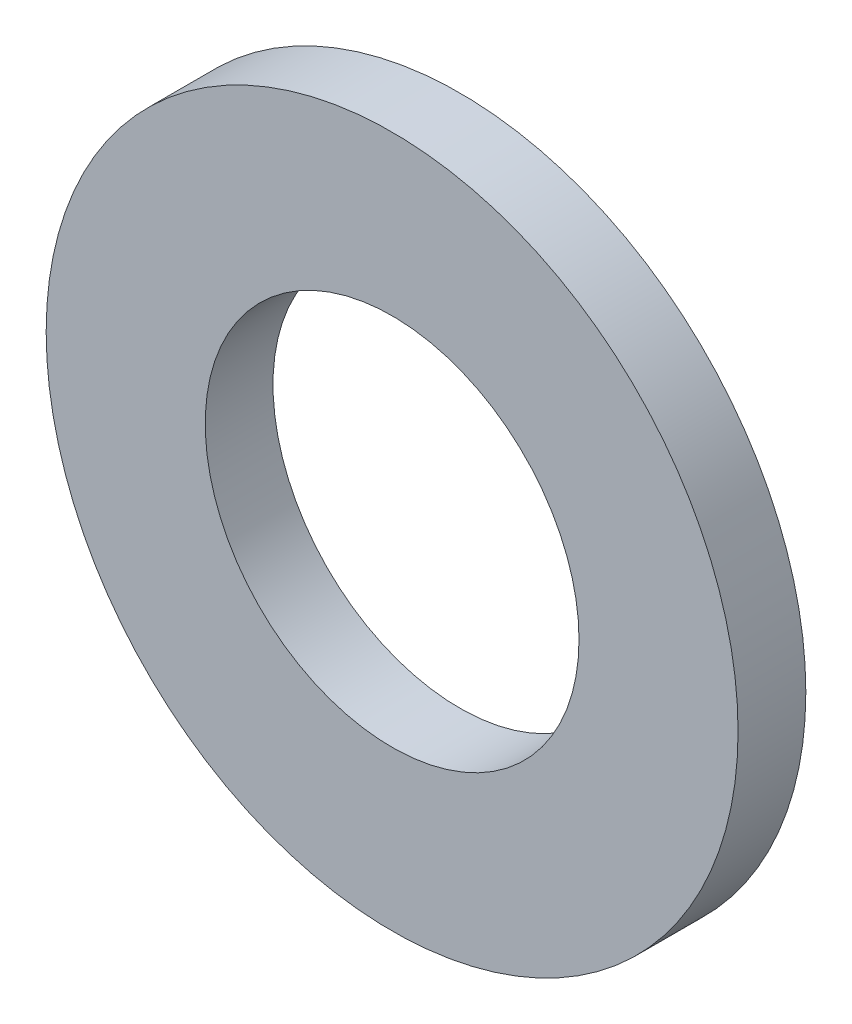
ISO-10303-21;
HEADER;
FILE_DESCRIPTION(('STEP AP214'),'2;1');
FILE_NAME('part.step','',(''),(''),'','','');
FILE_SCHEMA(('AUTOMOTIVE_DESIGN { 1 0 10303 214 1 1 1 1 }'));
ENDSEC;
DATA;
#1=APPLICATION_CONTEXT('core data for automotive mechanical design processes');
#2=APPLICATION_PROTOCOL_DEFINITION('international standard','automotive_design',2000,#1);
#3=PRODUCT_CONTEXT('',#1,'mechanical');
#4=PRODUCT('Part','Part','',(#3));
#5=PRODUCT_RELATED_PRODUCT_CATEGORY('part','',(#4));
#6=PRODUCT_DEFINITION_FORMATION('','',#4);
#7=PRODUCT_DEFINITION_CONTEXT('part definition',#1,'design');
#8=PRODUCT_DEFINITION('design','',#6,#7);
#9=PRODUCT_DEFINITION_SHAPE('','',#8);
#10=(LENGTH_UNIT() NAMED_UNIT(*) SI_UNIT(.MILLI.,.METRE.));
#11=(NAMED_UNIT(*) PLANE_ANGLE_UNIT() SI_UNIT($,.RADIAN.));
#12=(NAMED_UNIT(*) SI_UNIT($,.STERADIAN.) SOLID_ANGLE_UNIT());
#13=UNCERTAINTY_MEASURE_WITH_UNIT(LENGTH_MEASURE(1.E-05),#10,'distance_accuracy_value','');
#14=(GEOMETRIC_REPRESENTATION_CONTEXT(3) GLOBAL_UNCERTAINTY_ASSIGNED_CONTEXT((#13)) GLOBAL_UNIT_ASSIGNED_CONTEXT((#10,
#11,#12)) REPRESENTATION_CONTEXT('',''));
#15=CARTESIAN_POINT('',(0.,0.,0.));
#16=DIRECTION('',(0.,0.,1.));
#17=DIRECTION('',(1.,0.,0.));
#18=AXIS2_PLACEMENT_3D('',#15,#16,#17);
#19=CARTESIAN_POINT('',(0.,0.,0.));
#20=DIRECTION('',(0.,0.,1.));
#21=DIRECTION('',(1.,0.,0.));
#22=AXIS2_PLACEMENT_3D('',#19,#20,#21);
#23=PLANE('',#22);
#24=CARTESIAN_POINT('',(0.,0.,0.));
#25=DIRECTION('',(0.,0.,1.));
#26=DIRECTION('',(1.,0.,0.));
#27=AXIS2_PLACEMENT_3D('',#24,#25,#26);
#28=CIRCLE('',#27,1.75);
#29=CARTESIAN_POINT('',(1.75,0.,0.));
#30=VERTEX_POINT('',#29);
#31=EDGE_CURVE('E27',#30,#30,#28,.T.);
#32=ORIENTED_EDGE('',*,*,#31,.T.);
#33=EDGE_LOOP('',(#32));
#34=FACE_BOUND('',#33,.T.);
#35=CARTESIAN_POINT('',(0.,0.,0.));
#36=DIRECTION('',(0.,0.,-1.));
#37=DIRECTION('',(-1.,0.,0.));
#38=AXIS2_PLACEMENT_3D('',#35,#36,#37);
#39=CIRCLE('',#38,3.23933566792535);
#40=CARTESIAN_POINT('',(-3.23933566792535,0.,0.));
#41=VERTEX_POINT('',#40);
#42=EDGE_CURVE('E18',#41,#41,#39,.F.);
#43=ORIENTED_EDGE('',*,*,#42,.F.);
#44=EDGE_LOOP('',(#43));
#45=FACE_BOUND('',#44,.T.);
#46=ADVANCED_FACE('F15',(#34,#45),#23,.F.);
#47=CARTESIAN_POINT('',(0.,0.,0.634509397396116));
#48=DIRECTION('',(0.,0.,-1.));
#49=DIRECTION('',(-1.,0.,0.));
#50=AXIS2_PLACEMENT_3D('',#47,#48,#49);
#51=CYLINDRICAL_SURFACE('',#50,3.23933566792535);
#52=ORIENTED_EDGE('',*,*,#42,.T.);
#53=EDGE_LOOP('',(#52));
#54=FACE_BOUND('',#53,.T.);
#55=CARTESIAN_POINT('',(0.,0.,0.634509397396116));
#56=DIRECTION('',(0.,0.,-1.));
#57=DIRECTION('',(-1.,0.,0.));
#58=AXIS2_PLACEMENT_3D('',#55,#56,#57);
#59=CIRCLE('',#58,3.23933566792535);
#60=CARTESIAN_POINT('',(-3.23933566792535,0.,0.634509397396116));
#61=VERTEX_POINT('',#60);
#62=EDGE_CURVE('E22',#61,#61,#59,.F.);
#63=ORIENTED_EDGE('',*,*,#62,.F.);
#64=EDGE_LOOP('',(#63));
#65=FACE_BOUND('',#64,.T.);
#66=ADVANCED_FACE('F35',(#54,#65),#51,.T.);
#67=CARTESIAN_POINT('',(0.,0.,-2.12999580107928));
#68=DIRECTION('',(0.,0.,1.));
#69=DIRECTION('',(1.,0.,0.));
#70=AXIS2_PLACEMENT_3D('',#67,#68,#69);
#71=CYLINDRICAL_SURFACE('',#70,1.75);
#72=ORIENTED_EDGE('',*,*,#31,.F.);
#73=EDGE_LOOP('',(#72));
#74=FACE_BOUND('',#73,.T.);
#75=CARTESIAN_POINT('',(0.,0.,0.634509397396109));
#76=DIRECTION('',(0.,0.,1.));
#77=DIRECTION('',(1.,0.,0.));
#78=AXIS2_PLACEMENT_3D('',#75,#76,#77);
#79=CIRCLE('',#78,1.75);
#80=CARTESIAN_POINT('',(1.75,0.,0.634509397396109));
#81=VERTEX_POINT('',#80);
#82=EDGE_CURVE('E10',#81,#81,#79,.F.);
#83=ORIENTED_EDGE('',*,*,#82,.F.);
#84=EDGE_LOOP('',(#83));
#85=FACE_BOUND('',#84,.T.);
#86=ADVANCED_FACE('F43',(#74,#85),#71,.F.);
#87=CARTESIAN_POINT('',(0.,0.,0.634509397396116));
#88=DIRECTION('',(0.,0.,1.));
#89=DIRECTION('',(1.,0.,0.));
#90=AXIS2_PLACEMENT_3D('',#87,#88,#89);
#91=PLANE('',#90);
#92=ORIENTED_EDGE('',*,*,#82,.T.);
#93=EDGE_LOOP('',(#92));
#94=FACE_BOUND('',#93,.T.);
#95=ORIENTED_EDGE('',*,*,#62,.T.);
#96=EDGE_LOOP('',(#95));
#97=FACE_BOUND('',#96,.T.);
#98=ADVANCED_FACE('F44',(#94,#97),#91,.T.);
#99=CLOSED_SHELL('',(#46,#66,#86,#98));
#100=MANIFOLD_SOLID_BREP('B1',#99);
#101=ADVANCED_BREP_SHAPE_REPRESENTATION('',(#18,#100),#14);
#102=SHAPE_DEFINITION_REPRESENTATION(#9,#101);
ENDSEC;
END-ISO-10303-21;
